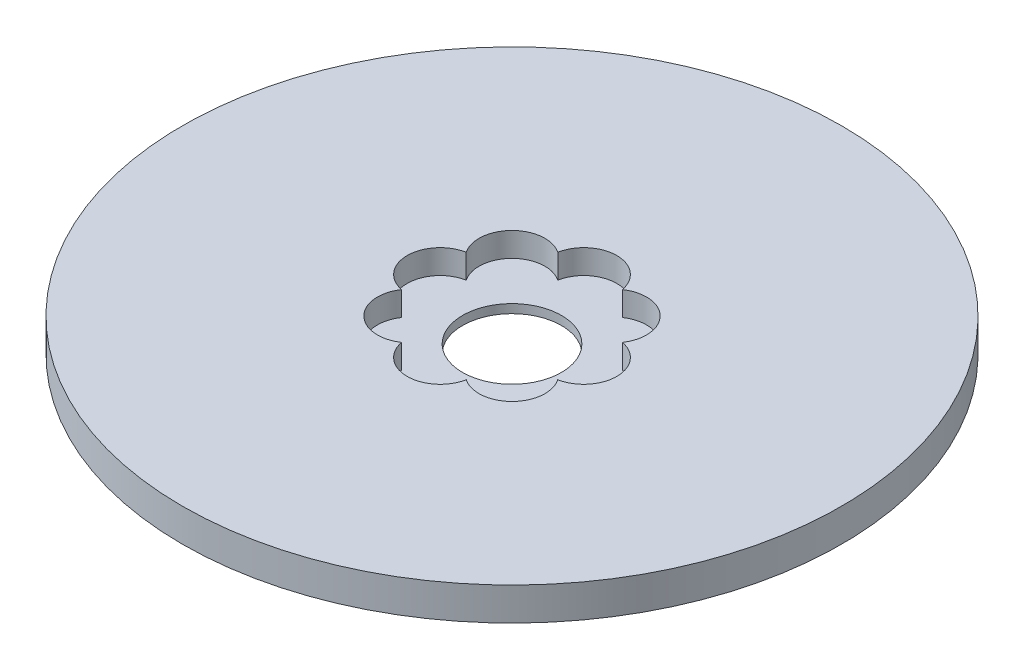
ISO-10303-21;
HEADER;
FILE_DESCRIPTION(('STEP AP214'),'2;1');
FILE_NAME('part.step','',(''),(''),'','','');
FILE_SCHEMA(('AUTOMOTIVE_DESIGN { 1 0 10303 214 1 1 1 1 }'));
ENDSEC;
DATA;
#1=APPLICATION_CONTEXT('core data for automotive mechanical design processes');
#2=APPLICATION_PROTOCOL_DEFINITION('international standard','automotive_design',2000,#1);
#3=PRODUCT_CONTEXT('',#1,'mechanical');
#4=PRODUCT('Part','Part','',(#3));
#5=PRODUCT_RELATED_PRODUCT_CATEGORY('part','',(#4));
#6=PRODUCT_DEFINITION_FORMATION('','',#4);
#7=PRODUCT_DEFINITION_CONTEXT('part definition',#1,'design');
#8=PRODUCT_DEFINITION('design','',#6,#7);
#9=PRODUCT_DEFINITION_SHAPE('','',#8);
#10=(LENGTH_UNIT() NAMED_UNIT(*) SI_UNIT(.MILLI.,.METRE.));
#11=(NAMED_UNIT(*) PLANE_ANGLE_UNIT() SI_UNIT($,.RADIAN.));
#12=(NAMED_UNIT(*) SI_UNIT($,.STERADIAN.) SOLID_ANGLE_UNIT());
#13=UNCERTAINTY_MEASURE_WITH_UNIT(LENGTH_MEASURE(1.E-05),#10,'distance_accuracy_value','');
#14=(GEOMETRIC_REPRESENTATION_CONTEXT(3) GLOBAL_UNCERTAINTY_ASSIGNED_CONTEXT((#13)) GLOBAL_UNIT_ASSIGNED_CONTEXT((#10,
#11,#12)) REPRESENTATION_CONTEXT('',''));
#15=CARTESIAN_POINT('',(0.,0.,0.));
#16=DIRECTION('',(0.,0.,1.));
#17=DIRECTION('',(1.,0.,0.));
#18=AXIS2_PLACEMENT_3D('',#15,#16,#17);
#19=CARTESIAN_POINT('',(0.,10.,0.));
#20=DIRECTION('',(0.,-1.,0.));
#21=DIRECTION('',(0.,0.,-1.));
#22=AXIS2_PLACEMENT_3D('',#19,#20,#21);
#23=CYLINDRICAL_SURFACE('',#22,15.);
#24=CARTESIAN_POINT('',(0.,0.,0.));
#25=DIRECTION('',(0.,1.,0.));
#26=DIRECTION('',(0.,0.,1.));
#27=AXIS2_PLACEMENT_3D('',#24,#25,#26);
#28=CIRCLE('',#27,15.);
#29=CARTESIAN_POINT('',(0.,0.,15.));
#30=VERTEX_POINT('',#29);
#31=EDGE_CURVE('E166',#30,#30,#28,.T.);
#32=ORIENTED_EDGE('',*,*,#31,.F.);
#33=EDGE_LOOP('',(#32));
#34=FACE_BOUND('',#33,.T.);
#35=CARTESIAN_POINT('',(0.,2.65730265990987,0.));
#36=DIRECTION('',(0.,1.,0.));
#37=DIRECTION('',(0.,0.,1.));
#38=AXIS2_PLACEMENT_3D('',#35,#36,#37);
#39=CIRCLE('',#38,15.);
#40=CARTESIAN_POINT('',(0.,2.65730265990987,15.));
#41=VERTEX_POINT('',#40);
#42=EDGE_CURVE('E11',#41,#41,#39,.T.);
#43=ORIENTED_EDGE('',*,*,#42,.T.);
#44=EDGE_LOOP('',(#43));
#45=FACE_BOUND('',#44,.T.);
#46=ADVANCED_FACE('F39',(#34,#45),#23,.F.);
#47=CARTESIAN_POINT('',(0.,10.,0.));
#48=DIRECTION('',(0.,-1.,0.));
#49=DIRECTION('',(0.,0.,-1.));
#50=AXIS2_PLACEMENT_3D('',#47,#48,#49);
#51=CYLINDRICAL_SURFACE('',#50,100.);
#52=CARTESIAN_POINT('',(0.,10.,0.));
#53=DIRECTION('',(0.,1.,0.));
#54=DIRECTION('',(0.,0.,1.));
#55=AXIS2_PLACEMENT_3D('',#52,#53,#54);
#56=CIRCLE('',#55,100.);
#57=CARTESIAN_POINT('',(0.,10.,100.));
#58=VERTEX_POINT('',#57);
#59=EDGE_CURVE('E50',#58,#58,#56,.T.);
#60=ORIENTED_EDGE('',*,*,#59,.F.);
#61=EDGE_LOOP('',(#60));
#62=FACE_BOUND('',#61,.T.);
#63=CARTESIAN_POINT('',(0.,0.,0.));
#64=DIRECTION('',(0.,1.,0.));
#65=DIRECTION('',(0.,0.,1.));
#66=AXIS2_PLACEMENT_3D('',#63,#64,#65);
#67=CIRCLE('',#66,100.);
#68=CARTESIAN_POINT('',(0.,0.,100.));
#69=VERTEX_POINT('',#68);
#70=EDGE_CURVE('E173',#69,#69,#67,.T.);
#71=ORIENTED_EDGE('',*,*,#70,.T.);
#72=EDGE_LOOP('',(#71));
#73=FACE_BOUND('',#72,.T.);
#74=ADVANCED_FACE('F41',(#62,#73),#51,.T.);
#75=CARTESIAN_POINT('',(0.,10.,0.));
#76=DIRECTION('',(0.,1.,0.));
#77=DIRECTION('',(0.,0.,1.));
#78=AXIS2_PLACEMENT_3D('',#75,#76,#77);
#79=PLANE('',#78);
#80=CARTESIAN_POINT('',(-15.4100137683587,10.,15.4100137683587));
#81=DIRECTION('',(0.,1.,0.));
#82=DIRECTION('',(0.707106781186549,0.,0.707106781186546));
#83=AXIS2_PLACEMENT_3D('',#80,#81,#82);
#84=CIRCLE('',#83,10.);
#85=CARTESIAN_POINT('',(-23.6993951971447,10.,9.81661091069717));
#86=VERTEX_POINT('',#85);
#87=CARTESIAN_POINT('',(-9.81661091069709,10.,23.6993951971448));
#88=VERTEX_POINT('',#87);
#89=EDGE_CURVE('E159',#86,#88,#84,.T.);
#90=ORIENTED_EDGE('',*,*,#89,.F.);
#91=CARTESIAN_POINT('',(-21.793050467569,10.,0.));
#92=DIRECTION('',(0.,1.,0.));
#93=DIRECTION('',(0.,0.,1.));
#94=AXIS2_PLACEMENT_3D('',#91,#92,#93);
#95=CIRCLE('',#94,10.);
#96=CARTESIAN_POINT('',(-23.6993951971451,10.,-9.81661091069711));
#97=VERTEX_POINT('',#96);
#98=EDGE_CURVE('E167',#97,#86,#95,.T.);
#99=ORIENTED_EDGE('',*,*,#98,.F.);
#100=CARTESIAN_POINT('',(-15.4100137683589,10.,-15.4100137683585));
#101=DIRECTION('',(0.,1.,0.));
#102=DIRECTION('',(-0.707106781186539,0.,0.707106781186556));
#103=AXIS2_PLACEMENT_3D('',#100,#101,#102);
#104=CIRCLE('',#103,10.);
#105=CARTESIAN_POINT('',(-9.81661091069742,10.,-23.6993951971446));
#106=VERTEX_POINT('',#105);
#107=EDGE_CURVE('E53',#106,#97,#104,.T.);
#108=ORIENTED_EDGE('',*,*,#107,.F.);
#109=CARTESIAN_POINT('',(-2.28270087071951E-13,10.,-21.793050467569));
#110=DIRECTION('',(0.,1.,0.));
#111=DIRECTION('',(-1.,0.,0.));
#112=AXIS2_PLACEMENT_3D('',#109,#110,#111);
#113=CIRCLE('',#112,10.);
#114=CARTESIAN_POINT('',(9.81661091069692,10.,-23.6993951971449));
#115=VERTEX_POINT('',#114);
#116=EDGE_CURVE('E117',#115,#106,#113,.T.);
#117=ORIENTED_EDGE('',*,*,#116,.F.);
#118=CARTESIAN_POINT('',(15.4100137683586,10.,-15.4100137683588));
#119=DIRECTION('',(0.,1.,0.));
#120=DIRECTION('',(-0.707106781186554,0.,-0.707106781186541));
#121=AXIS2_PLACEMENT_3D('',#118,#119,#120);
#122=CIRCLE('',#121,10.);
#123=CARTESIAN_POINT('',(23.6993951971446,10.,-9.8166109106972));
#124=VERTEX_POINT('',#123);
#125=EDGE_CURVE('E120',#124,#115,#122,.T.);
#126=ORIENTED_EDGE('',*,*,#125,.F.);
#127=CARTESIAN_POINT('',(21.793050467569,10.,0.));
#128=DIRECTION('',(0.,1.,0.));
#129=DIRECTION('',(0.,0.,-1.));
#130=AXIS2_PLACEMENT_3D('',#127,#128,#129);
#131=CIRCLE('',#130,10.);
#132=CARTESIAN_POINT('',(23.6993951971449,10.,9.81661091069714));
#133=VERTEX_POINT('',#132);
#134=EDGE_CURVE('E136',#133,#124,#131,.T.);
#135=ORIENTED_EDGE('',*,*,#134,.F.);
#136=CARTESIAN_POINT('',(15.4100137683588,10.,15.4100137683586));
#137=DIRECTION('',(0.,1.,0.));
#138=DIRECTION('',(0.707106781186544,0.,-0.707106781186551));
#139=AXIS2_PLACEMENT_3D('',#136,#137,#138);
#140=CIRCLE('',#139,10.);
#141=CARTESIAN_POINT('',(9.81661091069725,10.,23.6993951971447));
#142=VERTEX_POINT('',#141);
#143=EDGE_CURVE('E138',#142,#133,#140,.T.);
#144=ORIENTED_EDGE('',*,*,#143,.F.);
#145=CARTESIAN_POINT('',(0.,10.,21.793050467569));
#146=DIRECTION('',(0.,1.,0.));
#147=DIRECTION('',(1.,0.,0.));
#148=AXIS2_PLACEMENT_3D('',#145,#146,#147);
#149=CIRCLE('',#148,10.);
#150=EDGE_CURVE('E146',#88,#142,#149,.T.);
#151=ORIENTED_EDGE('',*,*,#150,.F.);
#152=EDGE_LOOP('',(#90,#99,#108,#117,#126,#135,#144,#151));
#153=FACE_BOUND('',#152,.T.);
#154=ORIENTED_EDGE('',*,*,#59,.T.);
#155=EDGE_LOOP('',(#154));
#156=FACE_BOUND('',#155,.T.);
#157=ADVANCED_FACE('F181',(#153,#156),#79,.T.);
#158=CARTESIAN_POINT('',(0.,0.,0.));
#159=DIRECTION('',(0.,1.,0.));
#160=DIRECTION('',(0.,0.,1.));
#161=AXIS2_PLACEMENT_3D('',#158,#159,#160);
#162=PLANE('',#161);
#163=ORIENTED_EDGE('',*,*,#31,.T.);
#164=EDGE_LOOP('',(#163));
#165=FACE_BOUND('',#164,.T.);
#166=ORIENTED_EDGE('',*,*,#70,.F.);
#167=EDGE_LOOP('',(#166));
#168=FACE_BOUND('',#167,.T.);
#169=ADVANCED_FACE('F179',(#165,#168),#162,.F.);
#170=CARTESIAN_POINT('',(-21.793050467569,2.65730265990987,0.));
#171=DIRECTION('',(0.,1.,0.));
#172=DIRECTION('',(0.,0.,1.));
#173=AXIS2_PLACEMENT_3D('',#170,#171,#172);
#174=CYLINDRICAL_SURFACE('',#173,10.);
#175=ORIENTED_EDGE('',*,*,#98,.T.);
#176=DIRECTION('',(0.,1.,0.));
#177=VECTOR('',#176,1.);
#178=CARTESIAN_POINT('',(-23.6993951971447,6.32865132995493,9.81661091069717));
#179=LINE('',#178,#177);
#180=CARTESIAN_POINT('',(-23.6993951971447,2.65730265990987,9.81661091069717));
#181=VERTEX_POINT('',#180);
#182=EDGE_CURVE('E65',#86,#181,#179,.F.);
#183=ORIENTED_EDGE('',*,*,#182,.T.);
#184=CARTESIAN_POINT('',(-21.793050467569,2.65730265990987,0.));
#185=DIRECTION('',(0.,1.,0.));
#186=DIRECTION('',(0.,0.,1.));
#187=AXIS2_PLACEMENT_3D('',#184,#185,#186);
#188=CIRCLE('',#187,10.);
#189=CARTESIAN_POINT('',(-23.6993951971451,2.65730265990987,-9.81661091069711));
#190=VERTEX_POINT('',#189);
#191=EDGE_CURVE('E170',#190,#181,#188,.T.);
#192=ORIENTED_EDGE('',*,*,#191,.F.);
#193=DIRECTION('',(0.,1.,0.));
#194=VECTOR('',#193,1.);
#195=CARTESIAN_POINT('',(-23.6993951971451,6.32865132995493,-9.81661091069711));
#196=LINE('',#195,#194);
#197=EDGE_CURVE('E124',#190,#97,#196,.T.);
#198=ORIENTED_EDGE('',*,*,#197,.T.);
#199=EDGE_LOOP('',(#175,#183,#192,#198));
#200=FACE_BOUND('',#199,.T.);
#201=ADVANCED_FACE('F185',(#200),#174,.F.);
#202=CARTESIAN_POINT('',(-21.793050467569,2.65730265990987,0.));
#203=DIRECTION('',(0.,1.,0.));
#204=DIRECTION('',(0.,0.,1.));
#205=AXIS2_PLACEMENT_3D('',#202,#203,#204);
#206=PLANE('',#205);
#207=ORIENTED_EDGE('',*,*,#191,.T.);
#208=CARTESIAN_POINT('',(-15.4100137683587,2.65730265990987,15.4100137683587));
#209=DIRECTION('',(0.,1.,0.));
#210=DIRECTION('',(0.707106781186549,0.,0.707106781186546));
#211=AXIS2_PLACEMENT_3D('',#208,#209,#210);
#212=CIRCLE('',#211,10.);
#213=CARTESIAN_POINT('',(-9.81661091069709,2.65730265990987,23.6993951971448));
#214=VERTEX_POINT('',#213);
#215=EDGE_CURVE('E161',#181,#214,#212,.T.);
#216=ORIENTED_EDGE('',*,*,#215,.T.);
#217=CARTESIAN_POINT('',(0.,2.65730265990987,21.793050467569));
#218=DIRECTION('',(0.,1.,0.));
#219=DIRECTION('',(1.,0.,0.));
#220=AXIS2_PLACEMENT_3D('',#217,#218,#219);
#221=CIRCLE('',#220,10.);
#222=CARTESIAN_POINT('',(9.81661091069725,2.65730265990987,23.6993951971447));
#223=VERTEX_POINT('',#222);
#224=EDGE_CURVE('E149',#214,#223,#221,.T.);
#225=ORIENTED_EDGE('',*,*,#224,.T.);
#226=CARTESIAN_POINT('',(15.4100137683588,2.65730265990987,15.4100137683586));
#227=DIRECTION('',(0.,1.,0.));
#228=DIRECTION('',(0.707106781186544,0.,-0.707106781186551));
#229=AXIS2_PLACEMENT_3D('',#226,#227,#228);
#230=CIRCLE('',#229,10.);
#231=CARTESIAN_POINT('',(23.6993951971449,2.65730265990987,9.81661091069714));
#232=VERTEX_POINT('',#231);
#233=EDGE_CURVE('E143',#223,#232,#230,.T.);
#234=ORIENTED_EDGE('',*,*,#233,.T.);
#235=CARTESIAN_POINT('',(21.793050467569,2.65730265990987,0.));
#236=DIRECTION('',(0.,1.,0.));
#237=DIRECTION('',(0.,0.,-1.));
#238=AXIS2_PLACEMENT_3D('',#235,#236,#237);
#239=CIRCLE('',#238,10.);
#240=CARTESIAN_POINT('',(23.6993951971446,2.65730265990987,-9.8166109106972));
#241=VERTEX_POINT('',#240);
#242=EDGE_CURVE('E140',#232,#241,#239,.T.);
#243=ORIENTED_EDGE('',*,*,#242,.T.);
#244=CARTESIAN_POINT('',(15.4100137683586,2.65730265990987,-15.4100137683588));
#245=DIRECTION('',(0.,1.,0.));
#246=DIRECTION('',(-0.707106781186554,0.,-0.707106781186541));
#247=AXIS2_PLACEMENT_3D('',#244,#245,#246);
#248=CIRCLE('',#247,10.);
#249=CARTESIAN_POINT('',(9.81661091069692,2.65730265990987,-23.6993951971449));
#250=VERTEX_POINT('',#249);
#251=EDGE_CURVE('E111',#241,#250,#248,.T.);
#252=ORIENTED_EDGE('',*,*,#251,.T.);
#253=CARTESIAN_POINT('',(-2.28270087071951E-13,2.65730265990987,-21.793050467569));
#254=DIRECTION('',(0.,1.,0.));
#255=DIRECTION('',(-1.,0.,0.));
#256=AXIS2_PLACEMENT_3D('',#253,#254,#255);
#257=CIRCLE('',#256,10.);
#258=CARTESIAN_POINT('',(-9.81661091069742,2.65730265990987,-23.6993951971446));
#259=VERTEX_POINT('',#258);
#260=EDGE_CURVE('E104',#250,#259,#257,.T.);
#261=ORIENTED_EDGE('',*,*,#260,.T.);
#262=CARTESIAN_POINT('',(-15.4100137683589,2.65730265990987,-15.4100137683585));
#263=DIRECTION('',(0.,1.,0.));
#264=DIRECTION('',(-0.707106781186539,0.,0.707106781186556));
#265=AXIS2_PLACEMENT_3D('',#262,#263,#264);
#266=CIRCLE('',#265,10.);
#267=EDGE_CURVE('E112',#259,#190,#266,.T.);
#268=ORIENTED_EDGE('',*,*,#267,.T.);
#269=EDGE_LOOP('',(#207,#216,#225,#234,#243,#252,#261,#268));
#270=FACE_BOUND('',#269,.T.);
#271=ORIENTED_EDGE('',*,*,#42,.F.);
#272=EDGE_LOOP('',(#271));
#273=FACE_BOUND('',#272,.T.);
#274=ADVANCED_FACE('F107',(#270,#273),#206,.T.);
#275=CARTESIAN_POINT('',(-15.4100137683587,2.65730265990987,15.4100137683587));
#276=DIRECTION('',(0.,1.,0.));
#277=DIRECTION('',(0.,0.,1.));
#278=AXIS2_PLACEMENT_3D('',#275,#276,#277);
#279=CYLINDRICAL_SURFACE('',#278,10.);
#280=ORIENTED_EDGE('',*,*,#89,.T.);
#281=DIRECTION('',(0.,1.,0.));
#282=VECTOR('',#281,1.);
#283=CARTESIAN_POINT('',(-9.81661091069709,6.32865132995493,23.6993951971448));
#284=LINE('',#283,#282);
#285=EDGE_CURVE('E160',#88,#214,#284,.F.);
#286=ORIENTED_EDGE('',*,*,#285,.T.);
#287=ORIENTED_EDGE('',*,*,#215,.F.);
#288=ORIENTED_EDGE('',*,*,#182,.F.);
#289=EDGE_LOOP('',(#280,#286,#287,#288));
#290=FACE_BOUND('',#289,.T.);
#291=ADVANCED_FACE('F202',(#290),#279,.F.);
#292=CARTESIAN_POINT('',(-15.4100137683589,2.65730265990987,-15.4100137683585));
#293=DIRECTION('',(0.,1.,0.));
#294=DIRECTION('',(0.,0.,1.));
#295=AXIS2_PLACEMENT_3D('',#292,#293,#294);
#296=CYLINDRICAL_SURFACE('',#295,10.);
#297=ORIENTED_EDGE('',*,*,#267,.F.);
#298=DIRECTION('',(0.,1.,0.));
#299=VECTOR('',#298,1.);
#300=CARTESIAN_POINT('',(-9.81661091069742,6.32865132995493,-23.6993951971446));
#301=LINE('',#300,#299);
#302=EDGE_CURVE('E119',#106,#259,#301,.F.);
#303=ORIENTED_EDGE('',*,*,#302,.F.);
#304=ORIENTED_EDGE('',*,*,#107,.T.);
#305=ORIENTED_EDGE('',*,*,#197,.F.);
#306=EDGE_LOOP('',(#297,#303,#304,#305));
#307=FACE_BOUND('',#306,.T.);
#308=ADVANCED_FACE('F123',(#307),#296,.F.);
#309=CARTESIAN_POINT('',(0.,2.65730265990987,21.793050467569));
#310=DIRECTION('',(0.,1.,0.));
#311=DIRECTION('',(0.,0.,1.));
#312=AXIS2_PLACEMENT_3D('',#309,#310,#311);
#313=CYLINDRICAL_SURFACE('',#312,10.);
#314=ORIENTED_EDGE('',*,*,#150,.T.);
#315=DIRECTION('',(0.,1.,0.));
#316=VECTOR('',#315,1.);
#317=CARTESIAN_POINT('',(9.81661091069725,6.32865132995493,23.6993951971447));
#318=LINE('',#317,#316);
#319=EDGE_CURVE('E141',#142,#223,#318,.F.);
#320=ORIENTED_EDGE('',*,*,#319,.T.);
#321=ORIENTED_EDGE('',*,*,#224,.F.);
#322=ORIENTED_EDGE('',*,*,#285,.F.);
#323=EDGE_LOOP('',(#314,#320,#321,#322));
#324=FACE_BOUND('',#323,.T.);
#325=ADVANCED_FACE('F208',(#324),#313,.F.);
#326=CARTESIAN_POINT('',(15.4100137683588,2.65730265990987,15.4100137683586));
#327=DIRECTION('',(0.,1.,0.));
#328=DIRECTION('',(0.,0.,1.));
#329=AXIS2_PLACEMENT_3D('',#326,#327,#328);
#330=CYLINDRICAL_SURFACE('',#329,10.);
#331=DIRECTION('',(0.,1.,0.));
#332=VECTOR('',#331,1.);
#333=CARTESIAN_POINT('',(23.6993951971449,6.32865132995493,9.81661091069714));
#334=LINE('',#333,#332);
#335=EDGE_CURVE('E151',#133,#232,#334,.F.);
#336=ORIENTED_EDGE('',*,*,#335,.T.);
#337=ORIENTED_EDGE('',*,*,#233,.F.);
#338=ORIENTED_EDGE('',*,*,#319,.F.);
#339=ORIENTED_EDGE('',*,*,#143,.T.);
#340=EDGE_LOOP('',(#336,#337,#338,#339));
#341=FACE_BOUND('',#340,.T.);
#342=ADVANCED_FACE('F211',(#341),#330,.F.);
#343=CARTESIAN_POINT('',(21.793050467569,2.65730265990987,0.));
#344=DIRECTION('',(0.,1.,0.));
#345=DIRECTION('',(0.,0.,1.));
#346=AXIS2_PLACEMENT_3D('',#343,#344,#345);
#347=CYLINDRICAL_SURFACE('',#346,10.);
#348=ORIENTED_EDGE('',*,*,#134,.T.);
#349=DIRECTION('',(0.,1.,0.));
#350=VECTOR('',#349,1.);
#351=CARTESIAN_POINT('',(23.6993951971446,6.32865132995493,-9.8166109106972));
#352=LINE('',#351,#350);
#353=EDGE_CURVE('E131',#124,#241,#352,.F.);
#354=ORIENTED_EDGE('',*,*,#353,.T.);
#355=ORIENTED_EDGE('',*,*,#242,.F.);
#356=ORIENTED_EDGE('',*,*,#335,.F.);
#357=EDGE_LOOP('',(#348,#354,#355,#356));
#358=FACE_BOUND('',#357,.T.);
#359=ADVANCED_FACE('F214',(#358),#347,.F.);
#360=CARTESIAN_POINT('',(15.4100137683586,2.65730265990987,-15.4100137683588));
#361=DIRECTION('',(0.,1.,0.));
#362=DIRECTION('',(0.,0.,1.));
#363=AXIS2_PLACEMENT_3D('',#360,#361,#362);
#364=CYLINDRICAL_SURFACE('',#363,10.);
#365=DIRECTION('',(0.,1.,0.));
#366=VECTOR('',#365,1.);
#367=CARTESIAN_POINT('',(9.81661091069692,6.32865132995493,-23.6993951971449));
#368=LINE('',#367,#366);
#369=EDGE_CURVE('E154',#115,#250,#368,.F.);
#370=ORIENTED_EDGE('',*,*,#369,.T.);
#371=ORIENTED_EDGE('',*,*,#251,.F.);
#372=ORIENTED_EDGE('',*,*,#353,.F.);
#373=ORIENTED_EDGE('',*,*,#125,.T.);
#374=EDGE_LOOP('',(#370,#371,#372,#373));
#375=FACE_BOUND('',#374,.T.);
#376=ADVANCED_FACE('F218',(#375),#364,.F.);
#377=CARTESIAN_POINT('',(-2.28270087071951E-13,2.65730265990987,-21.793050467569));
#378=DIRECTION('',(0.,1.,0.));
#379=DIRECTION('',(0.,0.,1.));
#380=AXIS2_PLACEMENT_3D('',#377,#378,#379);
#381=CYLINDRICAL_SURFACE('',#380,10.);
#382=ORIENTED_EDGE('',*,*,#116,.T.);
#383=ORIENTED_EDGE('',*,*,#302,.T.);
#384=ORIENTED_EDGE('',*,*,#260,.F.);
#385=ORIENTED_EDGE('',*,*,#369,.F.);
#386=EDGE_LOOP('',(#382,#383,#384,#385));
#387=FACE_BOUND('',#386,.T.);
#388=ADVANCED_FACE('F121',(#387),#381,.F.);
#389=CLOSED_SHELL('',(#46,#74,#157,#169,#201,#274,#291,#308,#325,#342,#359,#376,#388));
#390=MANIFOLD_SOLID_BREP('B2',#389);
#391=ADVANCED_BREP_SHAPE_REPRESENTATION('',(#18,#390),#14);
#392=SHAPE_DEFINITION_REPRESENTATION(#9,#391);
ENDSEC;
END-ISO-10303-21;
